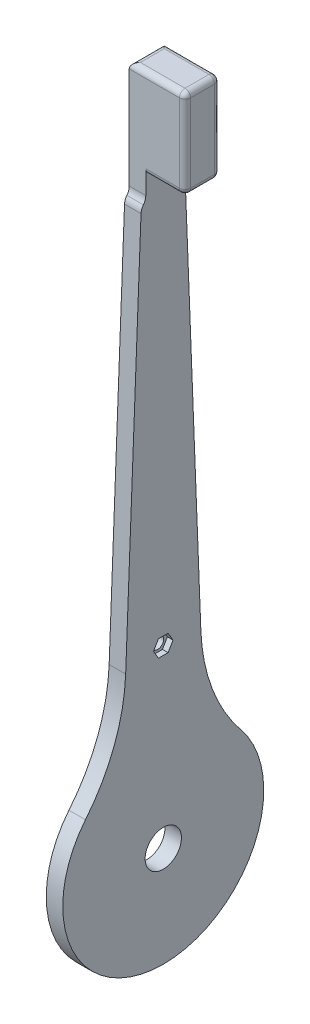
ISO-10303-21;
HEADER;
FILE_DESCRIPTION(('STEP AP214'),'2;1');
FILE_NAME('part.step','',(''),(''),'','','');
FILE_SCHEMA(('AUTOMOTIVE_DESIGN { 1 0 10303 214 1 1 1 1 }'));
ENDSEC;
DATA;
#1=APPLICATION_CONTEXT('core data for automotive mechanical design processes');
#2=APPLICATION_PROTOCOL_DEFINITION('international standard','automotive_design',2000,#1);
#3=PRODUCT_CONTEXT('',#1,'mechanical');
#4=PRODUCT('Part','Part','',(#3));
#5=PRODUCT_RELATED_PRODUCT_CATEGORY('part','',(#4));
#6=PRODUCT_DEFINITION_FORMATION('','',#4);
#7=PRODUCT_DEFINITION_CONTEXT('part definition',#1,'design');
#8=PRODUCT_DEFINITION('design','',#6,#7);
#9=PRODUCT_DEFINITION_SHAPE('','',#8);
#10=(LENGTH_UNIT() NAMED_UNIT(*) SI_UNIT(.MILLI.,.METRE.));
#11=(NAMED_UNIT(*) PLANE_ANGLE_UNIT() SI_UNIT($,.RADIAN.));
#12=(NAMED_UNIT(*) SI_UNIT($,.STERADIAN.) SOLID_ANGLE_UNIT());
#13=UNCERTAINTY_MEASURE_WITH_UNIT(LENGTH_MEASURE(1.E-05),#10,'distance_accuracy_value','');
#14=(GEOMETRIC_REPRESENTATION_CONTEXT(3) GLOBAL_UNCERTAINTY_ASSIGNED_CONTEXT((#13)) GLOBAL_UNIT_ASSIGNED_CONTEXT((#10,
#11,#12)) REPRESENTATION_CONTEXT('',''));
#15=CARTESIAN_POINT('',(0.,0.,0.));
#16=DIRECTION('',(0.,0.,1.));
#17=DIRECTION('',(1.,0.,0.));
#18=AXIS2_PLACEMENT_3D('',#15,#16,#17);
#19=CARTESIAN_POINT('',(3.175,49.887280480133,0.));
#20=DIRECTION('',(1.,0.,0.));
#21=DIRECTION('',(0.,0.,-1.));
#22=AXIS2_PLACEMENT_3D('',#19,#20,#21);
#23=CYLINDRICAL_SURFACE('',#22,1.72719999999999);
#24=CARTESIAN_POINT('',(-1.524,49.887280480133,0.));
#25=DIRECTION('',(1.,0.,0.));
#26=DIRECTION('',(0.,0.,-1.));
#27=AXIS2_PLACEMENT_3D('',#24,#25,#26);
#28=CIRCLE('',#27,1.7272);
#29=CARTESIAN_POINT('',(-1.524,49.887280480133,-1.7272));
#30=VERTEX_POINT('',#29);
#31=EDGE_CURVE('E266',#30,#30,#28,.T.);
#32=ORIENTED_EDGE('',*,*,#31,.F.);
#33=EDGE_LOOP('',(#32));
#34=FACE_BOUND('',#33,.T.);
#35=CARTESIAN_POINT('',(1.5748,49.887280480133,0.));
#36=DIRECTION('',(1.,0.,0.));
#37=DIRECTION('',(0.,0.,-1.));
#38=AXIS2_PLACEMENT_3D('',#35,#36,#37);
#39=CIRCLE('',#38,1.72719999999999);
#40=CARTESIAN_POINT('',(1.5748,49.887280480133,-1.72719999999999));
#41=VERTEX_POINT('',#40);
#42=EDGE_CURVE('E42',#41,#41,#39,.F.);
#43=ORIENTED_EDGE('',*,*,#42,.F.);
#44=EDGE_LOOP('',(#43));
#45=FACE_BOUND('',#44,.T.);
#46=ADVANCED_FACE('F38',(#34,#45),#23,.F.);
#47=CARTESIAN_POINT('',(-1.524,0.493768041256587,12.5672358479502));
#48=DIRECTION('',(0.,0.0392598157590686,0.999229036240723));
#49=DIRECTION('',(0.,-0.999229036240723,0.0392598157590686));
#50=AXIS2_PLACEMENT_3D('',#47,#48,#49);
#51=PLANE('',#50);
#52=DIRECTION('',(0.,-0.999229036240723,0.0392598157590686));
#53=VECTOR('',#52,1.);
#54=CARTESIAN_POINT('',(-1.524,0.493768041256587,12.5672358479502));
#55=LINE('',#54,#53);
#56=CARTESIAN_POINT('',(-1.524,159.453678557024,6.32168395385614));
#57=VERTEX_POINT('',#56);
#58=CARTESIAN_POINT('',(-1.524,48.2455749354104,10.6910622452694));
#59=VERTEX_POINT('',#58);
#60=EDGE_CURVE('E300',#57,#59,#55,.T.);
#61=ORIENTED_EDGE('',*,*,#60,.T.);
#62=DIRECTION('',(-1.,0.,0.));
#63=VECTOR('',#62,1.);
#64=CARTESIAN_POINT('',(3.175,48.2455749354104,10.6910622452694));
#65=LINE('',#64,#63);
#66=CARTESIAN_POINT('',(3.175,48.2455749354104,10.6910622452694));
#67=VERTEX_POINT('',#66);
#68=EDGE_CURVE('E386',#59,#67,#65,.F.);
#69=ORIENTED_EDGE('',*,*,#68,.T.);
#70=DIRECTION('',(0.,-0.999229036240723,0.0392598157590686));
#71=VECTOR('',#70,1.);
#72=CARTESIAN_POINT('',(3.175,0.493768041256587,12.5672358479502));
#73=LINE('',#72,#71);
#74=CARTESIAN_POINT('',(3.175,159.453678557024,6.32168395385613));
#75=VERTEX_POINT('',#74);
#76=EDGE_CURVE('E295',#75,#67,#73,.T.);
#77=ORIENTED_EDGE('',*,*,#76,.F.);
#78=DIRECTION('',(1.,0.,0.));
#79=VECTOR('',#78,1.);
#80=CARTESIAN_POINT('',(-1.524,159.453678557024,6.32168395385613));
#81=LINE('',#80,#79);
#82=EDGE_CURVE('E311',#75,#57,#81,.F.);
#83=ORIENTED_EDGE('',*,*,#82,.T.);
#84=EDGE_LOOP('',(#61,#69,#77,#83));
#85=FACE_BOUND('',#84,.T.);
#86=ADVANCED_FACE('F448',(#85),#51,.T.);
#87=CARTESIAN_POINT('',(-1.524,0.,0.));
#88=DIRECTION('',(1.,0.,0.));
#89=DIRECTION('',(0.,0.,-1.));
#90=AXIS2_PLACEMENT_3D('',#87,#88,#89);
#91=PLANE('',#90);
#92=ORIENTED_EDGE('',*,*,#31,.T.);
#93=EDGE_LOOP('',(#92));
#94=FACE_BOUND('',#93,.T.);
#95=CARTESIAN_POINT('',(-1.524,0.,0.));
#96=DIRECTION('',(1.,0.,0.));
#97=DIRECTION('',(0.,0.,-1.));
#98=AXIS2_PLACEMENT_3D('',#95,#96,#97);
#99=CIRCLE('',#98,5.15874);
#100=CARTESIAN_POINT('',(-1.524,0.,-5.15874));
#101=VERTEX_POINT('',#100);
#102=EDGE_CURVE('E272',#101,#101,#99,.T.);
#103=ORIENTED_EDGE('',*,*,#102,.T.);
#104=EDGE_LOOP('',(#103));
#105=FACE_BOUND('',#104,.T.);
#106=DIRECTION('',(0.,-1.,0.));
#107=VECTOR('',#106,1.);
#108=CARTESIAN_POINT('',(-1.524,0.,4.97712457241772));
#109=LINE('',#108,#107);
#110=CARTESIAN_POINT('',(-1.524,192.0875,4.97712457241776));
#111=VERTEX_POINT('',#110);
#112=CARTESIAN_POINT('',(-1.524,163.239599310937,4.97712457241776));
#113=VERTEX_POINT('',#112);
#114=EDGE_CURVE('E290',#111,#113,#109,.T.);
#115=ORIENTED_EDGE('',*,*,#114,.F.);
#116=DIRECTION('',(0.,0.,-1.));
#117=VECTOR('',#116,1.);
#118=CARTESIAN_POINT('',(-1.524,192.0875,0.));
#119=LINE('',#118,#117);
#120=CARTESIAN_POINT('',(-1.524,192.0875,-4.97712457241771));
#121=VERTEX_POINT('',#120);
#122=EDGE_CURVE('E379',#111,#121,#119,.T.);
#123=ORIENTED_EDGE('',*,*,#122,.T.);
#124=DIRECTION('',(0.,-1.,0.));
#125=VECTOR('',#124,1.);
#126=CARTESIAN_POINT('',(-1.524,0.,-4.97712457241771));
#127=LINE('',#126,#125);
#128=CARTESIAN_POINT('',(-1.524,163.239599310937,-4.97712457241771));
#129=VERTEX_POINT('',#128);
#130=EDGE_CURVE('E284',#121,#129,#127,.T.);
#131=ORIENTED_EDGE('',*,*,#130,.T.);
#132=CARTESIAN_POINT('',(-1.524,163.239599310937,-8.15212457241771));
#133=DIRECTION('',(1.,0.,0.));
#134=DIRECTION('',(0.,0.,-1.));
#135=AXIS2_PLACEMENT_3D('',#132,#133,#134);
#136=CIRCLE('',#135,3.175);
#137=CARTESIAN_POINT('',(-1.524,161.284313976463,-5.65062816810476));
#138=VERTEX_POINT('',#137);
#139=EDGE_CURVE('E339',#129,#138,#136,.T.);
#140=ORIENTED_EDGE('',*,*,#139,.T.);
#141=CARTESIAN_POINT('',(-1.524,159.329028641989,-3.1491317637918));
#142=DIRECTION('',(1.,0.,0.));
#143=DIRECTION('',(0.,0.,-1.));
#144=AXIS2_PLACEMENT_3D('',#141,#142,#143);
#145=CIRCLE('',#144,3.175);
#146=CARTESIAN_POINT('',(-1.524,159.453678557024,-6.32168395385609));
#147=VERTEX_POINT('',#146);
#148=EDGE_CURVE('E313',#138,#147,#145,.F.);
#149=ORIENTED_EDGE('',*,*,#148,.T.);
#150=DIRECTION('',(0.,-0.999229036240723,-0.0392598157590689));
#151=VECTOR('',#150,1.);
#152=CARTESIAN_POINT('',(-1.524,0.493768041256591,-12.5672358479503));
#153=LINE('',#152,#151);
#154=CARTESIAN_POINT('',(-1.524,48.2455749354104,-10.6910622452694));
#155=VERTEX_POINT('',#154);
#156=EDGE_CURVE('E303',#147,#155,#153,.T.);
#157=ORIENTED_EDGE('',*,*,#156,.T.);
#158=CARTESIAN_POINT('',(-1.524,50.2399735759711,-61.4518972862981));
#159=DIRECTION('',(1.,0.,0.));
#160=DIRECTION('',(0.,0.,-1.));
#161=AXIS2_PLACEMENT_3D('',#158,#159,#160);
#162=CIRCLE('',#161,50.8);
#163=CARTESIAN_POINT('',(-1.524,18.0863904873496,-22.1226830230673));
#164=VERTEX_POINT('',#163);
#165=EDGE_CURVE('E11',#155,#164,#162,.T.);
#166=ORIENTED_EDGE('',*,*,#165,.T.);
#167=CARTESIAN_POINT('',(-1.524,0.,0.));
#168=DIRECTION('',(1.,0.,0.));
#169=DIRECTION('',(0.,0.,-1.));
#170=AXIS2_PLACEMENT_3D('',#167,#168,#169);
#171=CIRCLE('',#170,28.575);
#172=CARTESIAN_POINT('',(-1.524,18.0863904873496,22.1226830230673));
#173=VERTEX_POINT('',#172);
#174=EDGE_CURVE('E277',#164,#173,#171,.F.);
#175=ORIENTED_EDGE('',*,*,#174,.T.);
#176=CARTESIAN_POINT('',(-1.524,50.239973575971,61.4518972862981));
#177=DIRECTION('',(1.,0.,0.));
#178=DIRECTION('',(0.,0.,-1.));
#179=AXIS2_PLACEMENT_3D('',#176,#177,#178);
#180=CIRCLE('',#179,50.8);
#181=EDGE_CURVE('E435',#173,#59,#180,.T.);
#182=ORIENTED_EDGE('',*,*,#181,.T.);
#183=ORIENTED_EDGE('',*,*,#60,.F.);
#184=CARTESIAN_POINT('',(-1.524,159.329028641989,3.14913176379184));
#185=DIRECTION('',(1.,0.,0.));
#186=DIRECTION('',(0.,0.,-1.));
#187=AXIS2_PLACEMENT_3D('',#184,#185,#186);
#188=CIRCLE('',#187,3.175);
#189=CARTESIAN_POINT('',(-1.524,161.284313976463,5.6506281681048));
#190=VERTEX_POINT('',#189);
#191=EDGE_CURVE('E315',#57,#190,#188,.F.);
#192=ORIENTED_EDGE('',*,*,#191,.T.);
#193=CARTESIAN_POINT('',(-1.524,163.239599310937,8.15212457241776));
#194=DIRECTION('',(1.,0.,0.));
#195=DIRECTION('',(0.,0.,-1.));
#196=AXIS2_PLACEMENT_3D('',#193,#194,#195);
#197=CIRCLE('',#196,3.175);
#198=EDGE_CURVE('E334',#190,#113,#197,.T.);
#199=ORIENTED_EDGE('',*,*,#198,.T.);
#200=EDGE_LOOP('',(#115,#123,#131,#140,#149,#157,#166,#175,#182,#183,#192,#199));
#201=FACE_BOUND('',#200,.T.);
#202=ADVANCED_FACE('F441',(#94,#105,#201),#91,.F.);
#203=CARTESIAN_POINT('',(3.175,0.,0.));
#204=DIRECTION('',(1.,0.,0.));
#205=DIRECTION('',(0.,0.,-1.));
#206=AXIS2_PLACEMENT_3D('',#203,#204,#205);
#207=PLANE('',#206);
#208=DIRECTION('',(0.,-0.866025403784438,-0.500000000000001));
#209=VECTOR('',#208,1.);
#210=CARTESIAN_POINT('',(3.175,49.8872804801304,2.76468815109874));
#211=LINE('',#210,#209);
#212=CARTESIAN_POINT('',(3.175,49.8872804801304,2.76468815109874));
#213=VERTEX_POINT('',#212);
#214=CARTESIAN_POINT('',(3.175,47.4929903077377,1.38234407554971));
#215=VERTEX_POINT('',#214);
#216=EDGE_CURVE('E54',#213,#215,#211,.T.);
#217=ORIENTED_EDGE('',*,*,#216,.F.);
#218=DIRECTION('',(0.,-0.866025403784439,0.499999999999999));
#219=VECTOR('',#218,1.);
#220=CARTESIAN_POINT('',(3.175,52.2815706525232,1.38234407554971));
#221=LINE('',#220,#219);
#222=CARTESIAN_POINT('',(3.175,52.2815706525232,1.38234407554971));
#223=VERTEX_POINT('',#222);
#224=EDGE_CURVE('E233',#223,#213,#221,.T.);
#225=ORIENTED_EDGE('',*,*,#224,.F.);
#226=DIRECTION('',(0.,0.,1.));
#227=VECTOR('',#226,1.);
#228=CARTESIAN_POINT('',(3.175,52.2815706525232,-1.38234407554836));
#229=LINE('',#228,#227);
#230=CARTESIAN_POINT('',(3.175,52.2815706525232,-1.38234407554836));
#231=VERTEX_POINT('',#230);
#232=EDGE_CURVE('E236',#231,#223,#229,.T.);
#233=ORIENTED_EDGE('',*,*,#232,.F.);
#234=DIRECTION('',(0.,0.866025403784439,0.499999999999999));
#235=VECTOR('',#234,1.);
#236=CARTESIAN_POINT('',(3.175,49.8872804801304,-2.76468815109739));
#237=LINE('',#236,#235);
#238=CARTESIAN_POINT('',(3.175,49.8872804801304,-2.76468815109739));
#239=VERTEX_POINT('',#238);
#240=EDGE_CURVE('E252',#239,#231,#237,.T.);
#241=ORIENTED_EDGE('',*,*,#240,.F.);
#242=DIRECTION('',(0.,0.866025403784439,-0.5));
#243=VECTOR('',#242,1.);
#244=CARTESIAN_POINT('',(3.175,47.4929903077377,-1.38234407554837));
#245=LINE('',#244,#243);
#246=CARTESIAN_POINT('',(3.175,47.4929903077377,-1.38234407554837));
#247=VERTEX_POINT('',#246);
#248=EDGE_CURVE('E249',#247,#239,#245,.T.);
#249=ORIENTED_EDGE('',*,*,#248,.F.);
#250=DIRECTION('',(0.,0.,-1.));
#251=VECTOR('',#250,1.);
#252=CARTESIAN_POINT('',(3.175,47.4929903077377,1.38234407554971));
#253=LINE('',#252,#251);
#254=EDGE_CURVE('E247',#215,#247,#253,.T.);
#255=ORIENTED_EDGE('',*,*,#254,.F.);
#256=EDGE_LOOP('',(#217,#225,#233,#241,#249,#255));
#257=FACE_BOUND('',#256,.T.);
#258=CARTESIAN_POINT('',(3.175,0.,0.));
#259=DIRECTION('',(1.,0.,0.));
#260=DIRECTION('',(0.,0.,-1.));
#261=AXIS2_PLACEMENT_3D('',#258,#259,#260);
#262=CIRCLE('',#261,5.15874);
#263=CARTESIAN_POINT('',(3.175,0.,-5.15874));
#264=VERTEX_POINT('',#263);
#265=EDGE_CURVE('E269',#264,#264,#262,.T.);
#266=ORIENTED_EDGE('',*,*,#265,.F.);
#267=EDGE_LOOP('',(#266));
#268=FACE_BOUND('',#267,.T.);
#269=DIRECTION('',(0.,-1.,0.));
#270=VECTOR('',#269,1.);
#271=CARTESIAN_POINT('',(3.175,0.,4.97712457241772));
#272=LINE('',#271,#270);
#273=CARTESIAN_POINT('',(3.175,169.8625,4.97712457241776));
#274=VERTEX_POINT('',#273);
#275=CARTESIAN_POINT('',(3.175,163.239599310937,4.97712457241776));
#276=VERTEX_POINT('',#275);
#277=EDGE_CURVE('E287',#274,#276,#272,.T.);
#278=ORIENTED_EDGE('',*,*,#277,.T.);
#279=CARTESIAN_POINT('',(3.175,163.239599310937,8.15212457241776));
#280=DIRECTION('',(1.,0.,0.));
#281=DIRECTION('',(0.,0.,-1.));
#282=AXIS2_PLACEMENT_3D('',#279,#280,#281);
#283=CIRCLE('',#282,3.175);
#284=CARTESIAN_POINT('',(3.175,161.284313976463,5.6506281681048));
#285=VERTEX_POINT('',#284);
#286=EDGE_CURVE('E332',#276,#285,#283,.F.);
#287=ORIENTED_EDGE('',*,*,#286,.T.);
#288=CARTESIAN_POINT('',(3.175,159.329028641989,3.14913176379184));
#289=DIRECTION('',(1.,0.,0.));
#290=DIRECTION('',(0.,0.,-1.));
#291=AXIS2_PLACEMENT_3D('',#288,#289,#290);
#292=CIRCLE('',#291,3.175);
#293=EDGE_CURVE('E309',#285,#75,#292,.T.);
#294=ORIENTED_EDGE('',*,*,#293,.T.);
#295=ORIENTED_EDGE('',*,*,#76,.T.);
#296=CARTESIAN_POINT('',(3.175,50.239973575971,61.4518972862981));
#297=DIRECTION('',(1.,0.,0.));
#298=DIRECTION('',(0.,0.,-1.));
#299=AXIS2_PLACEMENT_3D('',#296,#297,#298);
#300=CIRCLE('',#299,50.8);
#301=CARTESIAN_POINT('',(3.175,18.0863904873496,22.1226830230673));
#302=VERTEX_POINT('',#301);
#303=EDGE_CURVE('E433',#67,#302,#300,.F.);
#304=ORIENTED_EDGE('',*,*,#303,.T.);
#305=CARTESIAN_POINT('',(3.175,0.,0.));
#306=DIRECTION('',(1.,0.,0.));
#307=DIRECTION('',(0.,0.,-1.));
#308=AXIS2_PLACEMENT_3D('',#305,#306,#307);
#309=CIRCLE('',#308,28.575);
#310=CARTESIAN_POINT('',(3.175,18.0863904873496,-22.1226830230673));
#311=VERTEX_POINT('',#310);
#312=EDGE_CURVE('E275',#302,#311,#309,.T.);
#313=ORIENTED_EDGE('',*,*,#312,.T.);
#314=CARTESIAN_POINT('',(3.175,50.2399735759711,-61.4518972862981));
#315=DIRECTION('',(1.,0.,0.));
#316=DIRECTION('',(0.,0.,-1.));
#317=AXIS2_PLACEMENT_3D('',#314,#315,#316);
#318=CIRCLE('',#317,50.8);
#319=CARTESIAN_POINT('',(3.175,48.2455749354104,-10.6910622452694));
#320=VERTEX_POINT('',#319);
#321=EDGE_CURVE('E47',#311,#320,#318,.F.);
#322=ORIENTED_EDGE('',*,*,#321,.T.);
#323=DIRECTION('',(0.,-0.999229036240723,-0.0392598157590689));
#324=VECTOR('',#323,1.);
#325=CARTESIAN_POINT('',(3.175,0.493768041256591,-12.5672358479503));
#326=LINE('',#325,#324);
#327=CARTESIAN_POINT('',(3.175,159.453678557024,-6.32168395385609));
#328=VERTEX_POINT('',#327);
#329=EDGE_CURVE('E298',#328,#320,#326,.T.);
#330=ORIENTED_EDGE('',*,*,#329,.F.);
#331=CARTESIAN_POINT('',(3.175,159.329028641989,-3.1491317637918));
#332=DIRECTION('',(1.,0.,0.));
#333=DIRECTION('',(0.,0.,-1.));
#334=AXIS2_PLACEMENT_3D('',#331,#332,#333);
#335=CIRCLE('',#334,3.175);
#336=CARTESIAN_POINT('',(3.175,161.284313976463,-5.65062816810476));
#337=VERTEX_POINT('',#336);
#338=EDGE_CURVE('E306',#328,#337,#335,.T.);
#339=ORIENTED_EDGE('',*,*,#338,.T.);
#340=CARTESIAN_POINT('',(3.175,163.239599310937,-8.15212457241771));
#341=DIRECTION('',(1.,0.,0.));
#342=DIRECTION('',(0.,0.,-1.));
#343=AXIS2_PLACEMENT_3D('',#340,#341,#342);
#344=CIRCLE('',#343,3.175);
#345=CARTESIAN_POINT('',(3.175,163.239599310937,-4.97712457241771));
#346=VERTEX_POINT('',#345);
#347=EDGE_CURVE('E337',#337,#346,#344,.F.);
#348=ORIENTED_EDGE('',*,*,#347,.T.);
#349=DIRECTION('',(0.,-1.,0.));
#350=VECTOR('',#349,1.);
#351=CARTESIAN_POINT('',(3.175,0.,-4.97712457241771));
#352=LINE('',#351,#350);
#353=CARTESIAN_POINT('',(3.175,169.8625,-4.97712457241771));
#354=VERTEX_POINT('',#353);
#355=EDGE_CURVE('E281',#354,#346,#352,.T.);
#356=ORIENTED_EDGE('',*,*,#355,.F.);
#357=CARTESIAN_POINT('',(3.175,169.8625,-3.38962457241771));
#358=DIRECTION('',(1.,0.,0.));
#359=DIRECTION('',(0.,0.,-1.));
#360=AXIS2_PLACEMENT_3D('',#357,#358,#359);
#361=CIRCLE('',#360,1.5875);
#362=CARTESIAN_POINT('',(3.175,168.275,-3.38962457241771));
#363=VERTEX_POINT('',#362);
#364=EDGE_CURVE('E384',#354,#363,#361,.F.);
#365=ORIENTED_EDGE('',*,*,#364,.T.);
#366=DIRECTION('',(0.,0.,-1.));
#367=VECTOR('',#366,1.);
#368=CARTESIAN_POINT('',(3.175,168.275,4.97712457241776));
#369=LINE('',#368,#367);
#370=CARTESIAN_POINT('',(3.175,168.275,3.38962457241776));
#371=VERTEX_POINT('',#370);
#372=EDGE_CURVE('E292',#371,#363,#369,.T.);
#373=ORIENTED_EDGE('',*,*,#372,.F.);
#374=CARTESIAN_POINT('',(3.175,169.8625,3.38962457241776));
#375=DIRECTION('',(1.,0.,0.));
#376=DIRECTION('',(0.,0.,-1.));
#377=AXIS2_PLACEMENT_3D('',#374,#375,#376);
#378=CIRCLE('',#377,1.5875);
#379=EDGE_CURVE('E381',#371,#274,#378,.F.);
#380=ORIENTED_EDGE('',*,*,#379,.T.);
#381=EDGE_LOOP('',(#278,#287,#294,#295,#304,#313,#322,#330,#339,#348,#356,#365,#373,#380));
#382=FACE_BOUND('',#381,.T.);
#383=ADVANCED_FACE('F453',(#257,#268,#382),#207,.T.);
#384=CARTESIAN_POINT('',(-1.524,193.675,0.));
#385=DIRECTION('',(0.,-1.,0.));
#386=DIRECTION('',(0.,0.,-1.));
#387=AXIS2_PLACEMENT_3D('',#384,#385,#386);
#388=PLANE('',#387);
#389=DIRECTION('',(1.,0.,0.));
#390=VECTOR('',#389,1.);
#391=CARTESIAN_POINT('',(-1.524,193.675,-3.38962457241771));
#392=LINE('',#391,#390);
#393=CARTESIAN_POINT('',(12.7635,193.675,-3.38962457241771));
#394=VERTEX_POINT('',#393);
#395=CARTESIAN_POINT('',(0.0635,193.675,-3.38962457241771));
#396=VERTEX_POINT('',#395);
#397=EDGE_CURVE('E353',#394,#396,#392,.F.);
#398=ORIENTED_EDGE('',*,*,#397,.T.);
#399=DIRECTION('',(0.,0.,-1.));
#400=VECTOR('',#399,1.);
#401=CARTESIAN_POINT('',(0.0635,193.675,0.));
#402=LINE('',#401,#400);
#403=CARTESIAN_POINT('',(0.0635,193.675,3.38962457241776));
#404=VERTEX_POINT('',#403);
#405=EDGE_CURVE('E356',#396,#404,#402,.F.);
#406=ORIENTED_EDGE('',*,*,#405,.T.);
#407=DIRECTION('',(1.,0.,0.));
#408=VECTOR('',#407,1.);
#409=CARTESIAN_POINT('',(-1.524,193.675,3.38962457241776));
#410=LINE('',#409,#408);
#411=CARTESIAN_POINT('',(12.7635,193.675,3.38962457241776));
#412=VERTEX_POINT('',#411);
#413=EDGE_CURVE('E351',#404,#412,#410,.T.);
#414=ORIENTED_EDGE('',*,*,#413,.T.);
#415=DIRECTION('',(0.,0.,1.));
#416=VECTOR('',#415,1.);
#417=CARTESIAN_POINT('',(12.7635,193.675,-4.97712457241771));
#418=LINE('',#417,#416);
#419=EDGE_CURVE('E349',#412,#394,#418,.F.);
#420=ORIENTED_EDGE('',*,*,#419,.T.);
#421=EDGE_LOOP('',(#398,#406,#414,#420));
#422=FACE_BOUND('',#421,.T.);
#423=ADVANCED_FACE('F582',(#422),#388,.F.);
#424=CARTESIAN_POINT('',(-1.524,0.493768041256591,-12.5672358479503));
#425=DIRECTION('',(0.,-0.0392598157590689,0.999229036240723));
#426=DIRECTION('',(0.,-0.999229036240723,-0.0392598157590689));
#427=AXIS2_PLACEMENT_3D('',#424,#425,#426);
#428=PLANE('',#427);
#429=ORIENTED_EDGE('',*,*,#329,.T.);
#430=DIRECTION('',(1.,0.,0.));
#431=VECTOR('',#430,1.);
#432=CARTESIAN_POINT('',(-1.524,48.2455749354104,-10.6910622452694));
#433=LINE('',#432,#431);
#434=EDGE_CURVE('E431',#320,#155,#433,.F.);
#435=ORIENTED_EDGE('',*,*,#434,.T.);
#436=ORIENTED_EDGE('',*,*,#156,.F.);
#437=DIRECTION('',(-1.,0.,0.));
#438=VECTOR('',#437,1.);
#439=CARTESIAN_POINT('',(-1.524,159.453678557024,-6.32168395385609));
#440=LINE('',#439,#438);
#441=EDGE_CURVE('E318',#147,#328,#440,.F.);
#442=ORIENTED_EDGE('',*,*,#441,.T.);
#443=EDGE_LOOP('',(#429,#435,#436,#442));
#444=FACE_BOUND('',#443,.T.);
#445=ADVANCED_FACE('F462',(#444),#428,.F.);
#446=CARTESIAN_POINT('',(14.351,193.675,4.97712457241776));
#447=DIRECTION('',(0.,0.,-1.));
#448=DIRECTION('',(0.,1.,0.));
#449=AXIS2_PLACEMENT_3D('',#446,#447,#448);
#450=PLANE('',#449);
#451=ORIENTED_EDGE('',*,*,#277,.F.);
#452=DIRECTION('',(-1.,0.,0.));
#453=VECTOR('',#452,1.);
#454=CARTESIAN_POINT('',(14.351,169.8625,4.97712457241776));
#455=LINE('',#454,#453);
#456=CARTESIAN_POINT('',(12.7635,169.8625,4.97712457241776));
#457=VERTEX_POINT('',#456);
#458=EDGE_CURVE('E368',#274,#457,#455,.F.);
#459=ORIENTED_EDGE('',*,*,#458,.T.);
#460=DIRECTION('',(0.,-1.,0.));
#461=VECTOR('',#460,1.);
#462=CARTESIAN_POINT('',(12.7635,193.675,4.97712457241776));
#463=LINE('',#462,#461);
#464=CARTESIAN_POINT('',(12.7635,192.0875,4.97712457241776));
#465=VERTEX_POINT('',#464);
#466=EDGE_CURVE('E364',#457,#465,#463,.F.);
#467=ORIENTED_EDGE('',*,*,#466,.T.);
#468=DIRECTION('',(1.,0.,0.));
#469=VECTOR('',#468,1.);
#470=CARTESIAN_POINT('',(14.351,192.0875,4.97712457241776));
#471=LINE('',#470,#469);
#472=EDGE_CURVE('E366',#465,#111,#471,.F.);
#473=ORIENTED_EDGE('',*,*,#472,.T.);
#474=ORIENTED_EDGE('',*,*,#114,.T.);
#475=DIRECTION('',(-1.,0.,0.));
#476=VECTOR('',#475,1.);
#477=CARTESIAN_POINT('',(14.351,163.239599310937,4.97712457241776));
#478=LINE('',#477,#476);
#479=EDGE_CURVE('E321',#113,#276,#478,.F.);
#480=ORIENTED_EDGE('',*,*,#479,.T.);
#481=EDGE_LOOP('',(#451,#459,#467,#473,#474,#480));
#482=FACE_BOUND('',#481,.T.);
#483=ADVANCED_FACE('F512',(#482),#450,.F.);
#484=CARTESIAN_POINT('',(14.351,168.275,4.97712457241776));
#485=DIRECTION('',(0.,1.,0.));
#486=DIRECTION('',(0.,0.,1.));
#487=AXIS2_PLACEMENT_3D('',#484,#485,#486);
#488=PLANE('',#487);
#489=DIRECTION('',(0.,0.,-1.));
#490=VECTOR('',#489,1.);
#491=CARTESIAN_POINT('',(12.7635,168.275,4.97712457241776));
#492=LINE('',#491,#490);
#493=CARTESIAN_POINT('',(12.7635,168.275,-3.38962457241771));
#494=VERTEX_POINT('',#493);
#495=CARTESIAN_POINT('',(12.7635,168.275,3.38962457241776));
#496=VERTEX_POINT('',#495);
#497=EDGE_CURVE('E358',#494,#496,#492,.F.);
#498=ORIENTED_EDGE('',*,*,#497,.T.);
#499=DIRECTION('',(-1.,0.,0.));
#500=VECTOR('',#499,1.);
#501=CARTESIAN_POINT('',(14.351,168.275,3.38962457241776));
#502=LINE('',#501,#500);
#503=EDGE_CURVE('E362',#496,#371,#502,.T.);
#504=ORIENTED_EDGE('',*,*,#503,.T.);
#505=ORIENTED_EDGE('',*,*,#372,.T.);
#506=DIRECTION('',(-1.,0.,0.));
#507=VECTOR('',#506,1.);
#508=CARTESIAN_POINT('',(14.351,168.275,-3.38962457241771));
#509=LINE('',#508,#507);
#510=EDGE_CURVE('E360',#363,#494,#509,.F.);
#511=ORIENTED_EDGE('',*,*,#510,.T.);
#512=EDGE_LOOP('',(#498,#504,#505,#511));
#513=FACE_BOUND('',#512,.T.);
#514=ADVANCED_FACE('F485',(#513),#488,.F.);
#515=CARTESIAN_POINT('',(14.351,168.275,-4.97712457241771));
#516=DIRECTION('',(0.,0.,1.));
#517=DIRECTION('',(1.,0.,0.));
#518=AXIS2_PLACEMENT_3D('',#515,#516,#517);
#519=PLANE('',#518);
#520=DIRECTION('',(-1.,0.,0.));
#521=VECTOR('',#520,1.);
#522=CARTESIAN_POINT('',(14.351,169.8625,-4.97712457241771));
#523=LINE('',#522,#521);
#524=CARTESIAN_POINT('',(12.7635,169.8625,-4.97712457241771));
#525=VERTEX_POINT('',#524);
#526=EDGE_CURVE('E343',#525,#354,#523,.T.);
#527=ORIENTED_EDGE('',*,*,#526,.T.);
#528=ORIENTED_EDGE('',*,*,#355,.T.);
#529=DIRECTION('',(-1.,0.,0.));
#530=VECTOR('',#529,1.);
#531=CARTESIAN_POINT('',(14.351,163.239599310937,-4.97712457241771));
#532=LINE('',#531,#530);
#533=EDGE_CURVE('E329',#346,#129,#532,.T.);
#534=ORIENTED_EDGE('',*,*,#533,.T.);
#535=ORIENTED_EDGE('',*,*,#130,.F.);
#536=DIRECTION('',(1.,0.,0.));
#537=VECTOR('',#536,1.);
#538=CARTESIAN_POINT('',(14.351,192.0875,-4.97712457241771));
#539=LINE('',#538,#537);
#540=CARTESIAN_POINT('',(12.7635,192.0875,-4.97712457241771));
#541=VERTEX_POINT('',#540);
#542=EDGE_CURVE('E346',#121,#541,#539,.T.);
#543=ORIENTED_EDGE('',*,*,#542,.T.);
#544=DIRECTION('',(0.,1.,0.));
#545=VECTOR('',#544,1.);
#546=CARTESIAN_POINT('',(12.7635,168.275,-4.97712457241771));
#547=LINE('',#546,#545);
#548=EDGE_CURVE('E341',#541,#525,#547,.F.);
#549=ORIENTED_EDGE('',*,*,#548,.T.);
#550=EDGE_LOOP('',(#527,#528,#534,#535,#543,#549));
#551=FACE_BOUND('',#550,.T.);
#552=ADVANCED_FACE('F473',(#551),#519,.F.);
#553=CARTESIAN_POINT('',(14.351,0.,0.));
#554=DIRECTION('',(1.,0.,0.));
#555=DIRECTION('',(0.,0.,-1.));
#556=AXIS2_PLACEMENT_3D('',#553,#554,#555);
#557=PLANE('',#556);
#558=DIRECTION('',(0.,1.,0.));
#559=VECTOR('',#558,1.);
#560=CARTESIAN_POINT('',(14.351,193.675,-3.38962457241771));
#561=LINE('',#560,#559);
#562=CARTESIAN_POINT('',(14.351,169.8625,-3.38962457241771));
#563=VERTEX_POINT('',#562);
#564=CARTESIAN_POINT('',(14.351,192.0875,-3.38962457241771));
#565=VERTEX_POINT('',#564);
#566=EDGE_CURVE('E374',#563,#565,#561,.T.);
#567=ORIENTED_EDGE('',*,*,#566,.T.);
#568=DIRECTION('',(0.,0.,1.));
#569=VECTOR('',#568,1.);
#570=CARTESIAN_POINT('',(14.351,192.0875,4.97712457241776));
#571=LINE('',#570,#569);
#572=CARTESIAN_POINT('',(14.351,192.0875,3.38962457241776));
#573=VERTEX_POINT('',#572);
#574=EDGE_CURVE('E377',#565,#573,#571,.T.);
#575=ORIENTED_EDGE('',*,*,#574,.T.);
#576=DIRECTION('',(0.,-1.,0.));
#577=VECTOR('',#576,1.);
#578=CARTESIAN_POINT('',(14.351,168.275,3.38962457241776));
#579=LINE('',#578,#577);
#580=CARTESIAN_POINT('',(14.351,169.8625,3.38962457241776));
#581=VERTEX_POINT('',#580);
#582=EDGE_CURVE('E372',#573,#581,#579,.T.);
#583=ORIENTED_EDGE('',*,*,#582,.T.);
#584=DIRECTION('',(0.,0.,-1.));
#585=VECTOR('',#584,1.);
#586=CARTESIAN_POINT('',(14.351,169.8625,-4.97712457241771));
#587=LINE('',#586,#585);
#588=EDGE_CURVE('E370',#581,#563,#587,.T.);
#589=ORIENTED_EDGE('',*,*,#588,.T.);
#590=EDGE_LOOP('',(#567,#575,#583,#589));
#591=FACE_BOUND('',#590,.T.);
#592=ADVANCED_FACE('F503',(#591),#557,.T.);
#593=CARTESIAN_POINT('',(-6.35,159.329028641989,3.14913176379184));
#594=DIRECTION('',(-1.,0.,0.));
#595=DIRECTION('',(0.,0.,1.));
#596=AXIS2_PLACEMENT_3D('',#593,#594,#595);
#597=CYLINDRICAL_SURFACE('',#596,3.175);
#598=ORIENTED_EDGE('',*,*,#293,.F.);
#599=DIRECTION('',(-1.,0.,0.));
#600=VECTOR('',#599,1.);
#601=CARTESIAN_POINT('',(-6.35,161.284313976463,5.6506281681048));
#602=LINE('',#601,#600);
#603=EDGE_CURVE('E324',#285,#190,#602,.T.);
#604=ORIENTED_EDGE('',*,*,#603,.T.);
#605=ORIENTED_EDGE('',*,*,#191,.F.);
#606=ORIENTED_EDGE('',*,*,#82,.F.);
#607=EDGE_LOOP('',(#598,#604,#605,#606));
#608=FACE_BOUND('',#607,.T.);
#609=ADVANCED_FACE('F519',(#608),#597,.T.);
#610=CARTESIAN_POINT('',(-6.35,159.329028641989,-3.1491317637918));
#611=DIRECTION('',(-1.,0.,0.));
#612=DIRECTION('',(0.,0.,1.));
#613=AXIS2_PLACEMENT_3D('',#610,#611,#612);
#614=CYLINDRICAL_SURFACE('',#613,3.175);
#615=ORIENTED_EDGE('',*,*,#148,.F.);
#616=DIRECTION('',(-1.,0.,0.));
#617=VECTOR('',#616,1.);
#618=CARTESIAN_POINT('',(-6.35,161.284313976463,-5.65062816810476));
#619=LINE('',#618,#617);
#620=EDGE_CURVE('E326',#138,#337,#619,.F.);
#621=ORIENTED_EDGE('',*,*,#620,.T.);
#622=ORIENTED_EDGE('',*,*,#338,.F.);
#623=ORIENTED_EDGE('',*,*,#441,.F.);
#624=EDGE_LOOP('',(#615,#621,#622,#623));
#625=FACE_BOUND('',#624,.T.);
#626=ADVANCED_FACE('F468',(#625),#614,.T.);
#627=CARTESIAN_POINT('',(-6.35,163.239599310937,8.15212457241776));
#628=DIRECTION('',(-1.,0.,0.));
#629=DIRECTION('',(0.,0.,1.));
#630=AXIS2_PLACEMENT_3D('',#627,#628,#629);
#631=CYLINDRICAL_SURFACE('',#630,3.175);
#632=ORIENTED_EDGE('',*,*,#198,.F.);
#633=ORIENTED_EDGE('',*,*,#603,.F.);
#634=ORIENTED_EDGE('',*,*,#286,.F.);
#635=ORIENTED_EDGE('',*,*,#479,.F.);
#636=EDGE_LOOP('',(#632,#633,#634,#635));
#637=FACE_BOUND('',#636,.T.);
#638=ADVANCED_FACE('F521',(#637),#631,.F.);
#639=CARTESIAN_POINT('',(-6.35,163.239599310937,-8.15212457241771));
#640=DIRECTION('',(-1.,0.,0.));
#641=DIRECTION('',(0.,0.,1.));
#642=AXIS2_PLACEMENT_3D('',#639,#640,#641);
#643=CYLINDRICAL_SURFACE('',#642,3.175);
#644=ORIENTED_EDGE('',*,*,#139,.F.);
#645=ORIENTED_EDGE('',*,*,#533,.F.);
#646=ORIENTED_EDGE('',*,*,#347,.F.);
#647=ORIENTED_EDGE('',*,*,#620,.F.);
#648=EDGE_LOOP('',(#644,#645,#646,#647));
#649=FACE_BOUND('',#648,.T.);
#650=ADVANCED_FACE('F470',(#649),#643,.F.);
#651=CARTESIAN_POINT('',(14.351,169.8625,3.38962457241776));
#652=DIRECTION('',(-1.,0.,0.));
#653=DIRECTION('',(0.,0.,1.));
#654=AXIS2_PLACEMENT_3D('',#651,#652,#653);
#655=CYLINDRICAL_SURFACE('',#654,1.5875);
#656=CARTESIAN_POINT('',(12.7635,169.8625,3.38962457241776));
#657=DIRECTION('',(1.,0.,0.));
#658=DIRECTION('',(0.,0.,-1.));
#659=AXIS2_PLACEMENT_3D('',#656,#657,#658);
#660=CIRCLE('',#659,1.5875);
#661=EDGE_CURVE('E285',#457,#496,#660,.T.);
#662=ORIENTED_EDGE('',*,*,#661,.F.);
#663=ORIENTED_EDGE('',*,*,#458,.F.);
#664=ORIENTED_EDGE('',*,*,#379,.F.);
#665=ORIENTED_EDGE('',*,*,#503,.F.);
#666=EDGE_LOOP('',(#662,#663,#664,#665));
#667=FACE_BOUND('',#666,.T.);
#668=ADVANCED_FACE('F490',(#667),#655,.T.);
#669=CARTESIAN_POINT('',(12.7635,169.8625,3.38962457241776));
#670=DIRECTION('',(0.,0.,1.));
#671=DIRECTION('',(1.,0.,0.));
#672=AXIS2_PLACEMENT_3D('',#669,#670,#671);
#673=SPHERICAL_SURFACE('',#672,1.5875);
#674=CARTESIAN_POINT('',(12.7635,169.8625,3.38962457241776));
#675=DIRECTION('',(0.,-1.,0.));
#676=DIRECTION('',(0.,0.,-1.));
#677=AXIS2_PLACEMENT_3D('',#674,#675,#676);
#678=CIRCLE('',#677,1.5875);
#679=EDGE_CURVE('E416',#457,#581,#678,.F.);
#680=ORIENTED_EDGE('',*,*,#679,.F.);
#681=ORIENTED_EDGE('',*,*,#661,.T.);
#682=CARTESIAN_POINT('',(12.7635,169.8625,3.38962457241776));
#683=DIRECTION('',(0.,0.,1.));
#684=DIRECTION('',(1.,0.,0.));
#685=AXIS2_PLACEMENT_3D('',#682,#683,#684);
#686=CIRCLE('',#685,1.5875);
#687=EDGE_CURVE('E419',#581,#496,#686,.F.);
#688=ORIENTED_EDGE('',*,*,#687,.F.);
#689=EDGE_LOOP('',(#680,#681,#688));
#690=FACE_BOUND('',#689,.T.);
#691=ADVANCED_FACE('F495',(#690),#673,.T.);
#692=CARTESIAN_POINT('',(14.351,169.8625,-3.38962457241771));
#693=DIRECTION('',(-1.,0.,0.));
#694=DIRECTION('',(0.,0.,1.));
#695=AXIS2_PLACEMENT_3D('',#692,#693,#694);
#696=CYLINDRICAL_SURFACE('',#695,1.5875);
#697=ORIENTED_EDGE('',*,*,#364,.F.);
#698=ORIENTED_EDGE('',*,*,#526,.F.);
#699=CARTESIAN_POINT('',(12.7635,169.8625,-3.38962457241771));
#700=DIRECTION('',(1.,0.,0.));
#701=DIRECTION('',(0.,0.,-1.));
#702=AXIS2_PLACEMENT_3D('',#699,#700,#701);
#703=CIRCLE('',#702,1.5875);
#704=EDGE_CURVE('E413',#494,#525,#703,.T.);
#705=ORIENTED_EDGE('',*,*,#704,.F.);
#706=ORIENTED_EDGE('',*,*,#510,.F.);
#707=EDGE_LOOP('',(#697,#698,#705,#706));
#708=FACE_BOUND('',#707,.T.);
#709=ADVANCED_FACE('F481',(#708),#696,.T.);
#710=CARTESIAN_POINT('',(12.7635,169.8625,0.));
#711=DIRECTION('',(0.,0.,1.));
#712=DIRECTION('',(1.,0.,0.));
#713=AXIS2_PLACEMENT_3D('',#710,#711,#712);
#714=CYLINDRICAL_SURFACE('',#713,1.5875);
#715=ORIENTED_EDGE('',*,*,#687,.T.);
#716=ORIENTED_EDGE('',*,*,#497,.F.);
#717=CARTESIAN_POINT('',(12.7635,169.8625,-3.38962457241771));
#718=DIRECTION('',(0.,0.,-1.));
#719=DIRECTION('',(-1.,0.,0.));
#720=AXIS2_PLACEMENT_3D('',#717,#718,#719);
#721=CIRCLE('',#720,1.5875);
#722=EDGE_CURVE('E410',#563,#494,#721,.T.);
#723=ORIENTED_EDGE('',*,*,#722,.F.);
#724=ORIENTED_EDGE('',*,*,#588,.F.);
#725=EDGE_LOOP('',(#715,#716,#723,#724));
#726=FACE_BOUND('',#725,.T.);
#727=ADVANCED_FACE('F499',(#726),#714,.T.);
#728=CARTESIAN_POINT('',(12.7635,0.,3.38962457241774));
#729=DIRECTION('',(0.,1.,0.));
#730=DIRECTION('',(0.,0.,1.));
#731=AXIS2_PLACEMENT_3D('',#728,#729,#730);
#732=CYLINDRICAL_SURFACE('',#731,1.5875);
#733=ORIENTED_EDGE('',*,*,#679,.T.);
#734=ORIENTED_EDGE('',*,*,#582,.F.);
#735=CARTESIAN_POINT('',(12.7635,192.0875,3.38962457241776));
#736=DIRECTION('',(0.,1.,0.));
#737=DIRECTION('',(0.,0.,1.));
#738=AXIS2_PLACEMENT_3D('',#735,#736,#737);
#739=CIRCLE('',#738,1.5875);
#740=EDGE_CURVE('E407',#465,#573,#739,.T.);
#741=ORIENTED_EDGE('',*,*,#740,.F.);
#742=ORIENTED_EDGE('',*,*,#466,.F.);
#743=EDGE_LOOP('',(#733,#734,#741,#742));
#744=FACE_BOUND('',#743,.T.);
#745=ADVANCED_FACE('F509',(#744),#732,.T.);
#746=CARTESIAN_POINT('',(12.7635,169.8625,-3.38962457241771));
#747=DIRECTION('',(0.,0.,1.));
#748=DIRECTION('',(1.,0.,0.));
#749=AXIS2_PLACEMENT_3D('',#746,#747,#748);
#750=SPHERICAL_SURFACE('',#749,1.5875);
#751=ORIENTED_EDGE('',*,*,#722,.T.);
#752=ORIENTED_EDGE('',*,*,#704,.T.);
#753=CARTESIAN_POINT('',(12.7635,169.8625,-3.38962457241771));
#754=DIRECTION('',(0.,-1.,0.));
#755=DIRECTION('',(0.,0.,-1.));
#756=AXIS2_PLACEMENT_3D('',#753,#754,#755);
#757=CIRCLE('',#756,1.5875);
#758=EDGE_CURVE('E401',#563,#525,#757,.F.);
#759=ORIENTED_EDGE('',*,*,#758,.F.);
#760=EDGE_LOOP('',(#751,#752,#759));
#761=FACE_BOUND('',#760,.T.);
#762=ADVANCED_FACE('F543',(#761),#750,.T.);
#763=CARTESIAN_POINT('',(12.7635,192.0875,3.38962457241776));
#764=DIRECTION('',(0.,0.,1.));
#765=DIRECTION('',(1.,0.,0.));
#766=AXIS2_PLACEMENT_3D('',#763,#764,#765);
#767=SPHERICAL_SURFACE('',#766,1.5875);
#768=CARTESIAN_POINT('',(12.7635,192.0875,3.38962457241776));
#769=DIRECTION('',(0.,0.,1.));
#770=DIRECTION('',(1.,0.,0.));
#771=AXIS2_PLACEMENT_3D('',#768,#769,#770);
#772=CIRCLE('',#771,1.5875);
#773=EDGE_CURVE('E398',#412,#573,#772,.F.);
#774=ORIENTED_EDGE('',*,*,#773,.F.);
#775=CARTESIAN_POINT('',(12.7635,192.0875,3.38962457241776));
#776=DIRECTION('',(1.,0.,0.));
#777=DIRECTION('',(0.,0.,-1.));
#778=AXIS2_PLACEMENT_3D('',#775,#776,#777);
#779=CIRCLE('',#778,1.5875);
#780=EDGE_CURVE('E404',#465,#412,#779,.F.);
#781=ORIENTED_EDGE('',*,*,#780,.F.);
#782=ORIENTED_EDGE('',*,*,#740,.T.);
#783=EDGE_LOOP('',(#774,#781,#782));
#784=FACE_BOUND('',#783,.T.);
#785=ADVANCED_FACE('F545',(#784),#767,.T.);
#786=CARTESIAN_POINT('',(-1.524,192.0875,3.38962457241776));
#787=DIRECTION('',(1.,0.,0.));
#788=DIRECTION('',(0.,0.,-1.));
#789=AXIS2_PLACEMENT_3D('',#786,#787,#788);
#790=CYLINDRICAL_SURFACE('',#789,1.5875);
#791=ORIENTED_EDGE('',*,*,#780,.T.);
#792=ORIENTED_EDGE('',*,*,#413,.F.);
#793=CARTESIAN_POINT('',(0.0635,192.0875,3.38962457241776));
#794=DIRECTION('',(-0.707106781186547,0.,-0.707106781186547));
#795=DIRECTION('',(0.707106781186547,0.,-0.707106781186547));
#796=AXIS2_PLACEMENT_3D('',#793,#794,#795);
#797=ELLIPSE('',#796,2.24506403026729,1.5875);
#798=EDGE_CURVE('E395',#111,#404,#797,.T.);
#799=ORIENTED_EDGE('',*,*,#798,.F.);
#800=ORIENTED_EDGE('',*,*,#472,.F.);
#801=EDGE_LOOP('',(#791,#792,#799,#800));
#802=FACE_BOUND('',#801,.T.);
#803=ADVANCED_FACE('F526',(#802),#790,.T.);
#804=CARTESIAN_POINT('',(12.7635,0.,-3.38962457241771));
#805=DIRECTION('',(0.,-1.,0.));
#806=DIRECTION('',(0.,0.,-1.));
#807=AXIS2_PLACEMENT_3D('',#804,#805,#806);
#808=CYLINDRICAL_SURFACE('',#807,1.5875);
#809=ORIENTED_EDGE('',*,*,#758,.T.);
#810=ORIENTED_EDGE('',*,*,#548,.F.);
#811=CARTESIAN_POINT('',(12.7635,192.0875,-3.38962457241771));
#812=DIRECTION('',(0.,1.,0.));
#813=DIRECTION('',(0.,0.,1.));
#814=AXIS2_PLACEMENT_3D('',#811,#812,#813);
#815=CIRCLE('',#814,1.5875);
#816=EDGE_CURVE('E392',#565,#541,#815,.T.);
#817=ORIENTED_EDGE('',*,*,#816,.F.);
#818=ORIENTED_EDGE('',*,*,#566,.F.);
#819=EDGE_LOOP('',(#809,#810,#817,#818));
#820=FACE_BOUND('',#819,.T.);
#821=ADVANCED_FACE('F541',(#820),#808,.T.);
#822=CARTESIAN_POINT('',(12.7635,192.0875,0.));
#823=DIRECTION('',(0.,0.,-1.));
#824=DIRECTION('',(-1.,0.,0.));
#825=AXIS2_PLACEMENT_3D('',#822,#823,#824);
#826=CYLINDRICAL_SURFACE('',#825,1.5875);
#827=ORIENTED_EDGE('',*,*,#773,.T.);
#828=ORIENTED_EDGE('',*,*,#574,.F.);
#829=CARTESIAN_POINT('',(12.7635,192.0875,-3.38962457241771));
#830=DIRECTION('',(0.,0.,-1.));
#831=DIRECTION('',(-1.,0.,0.));
#832=AXIS2_PLACEMENT_3D('',#829,#830,#831);
#833=CIRCLE('',#832,1.5875);
#834=EDGE_CURVE('E390',#394,#565,#833,.T.);
#835=ORIENTED_EDGE('',*,*,#834,.F.);
#836=ORIENTED_EDGE('',*,*,#419,.F.);
#837=EDGE_LOOP('',(#827,#828,#835,#836));
#838=FACE_BOUND('',#837,.T.);
#839=ADVANCED_FACE('F606',(#838),#826,.T.);
#840=CARTESIAN_POINT('',(0.0635,192.0875,0.));
#841=DIRECTION('',(0.,0.,-1.));
#842=DIRECTION('',(-1.,0.,0.));
#843=AXIS2_PLACEMENT_3D('',#840,#841,#842);
#844=CYLINDRICAL_SURFACE('',#843,1.5875);
#845=ORIENTED_EDGE('',*,*,#798,.T.);
#846=ORIENTED_EDGE('',*,*,#405,.F.);
#847=CARTESIAN_POINT('',(0.0634999999999996,192.0875,-3.38962457241771));
#848=DIRECTION('',(0.707106781186547,0.,-0.707106781186547));
#849=DIRECTION('',(-0.707106781186547,0.,-0.707106781186547));
#850=AXIS2_PLACEMENT_3D('',#847,#848,#849);
#851=ELLIPSE('',#850,2.24506403026729,1.5875);
#852=EDGE_CURVE('E388',#121,#396,#851,.T.);
#853=ORIENTED_EDGE('',*,*,#852,.F.);
#854=ORIENTED_EDGE('',*,*,#122,.F.);
#855=EDGE_LOOP('',(#845,#846,#853,#854));
#856=FACE_BOUND('',#855,.T.);
#857=ADVANCED_FACE('F530',(#856),#844,.T.);
#858=CARTESIAN_POINT('',(12.7635,192.0875,-3.38962457241771));
#859=DIRECTION('',(0.,0.,1.));
#860=DIRECTION('',(1.,0.,0.));
#861=AXIS2_PLACEMENT_3D('',#858,#859,#860);
#862=SPHERICAL_SURFACE('',#861,1.5875);
#863=ORIENTED_EDGE('',*,*,#834,.T.);
#864=ORIENTED_EDGE('',*,*,#816,.T.);
#865=CARTESIAN_POINT('',(12.7635,192.0875,-3.38962457241771));
#866=DIRECTION('',(1.,0.,0.));
#867=DIRECTION('',(0.,0.,-1.));
#868=AXIS2_PLACEMENT_3D('',#865,#866,#867);
#869=CIRCLE('',#868,1.5875);
#870=EDGE_CURVE('E280',#394,#541,#869,.F.);
#871=ORIENTED_EDGE('',*,*,#870,.F.);
#872=EDGE_LOOP('',(#863,#864,#871));
#873=FACE_BOUND('',#872,.T.);
#874=ADVANCED_FACE('F538',(#873),#862,.T.);
#875=CARTESIAN_POINT('',(14.351,192.0875,-3.38962457241771));
#876=DIRECTION('',(1.,0.,0.));
#877=DIRECTION('',(0.,0.,-1.));
#878=AXIS2_PLACEMENT_3D('',#875,#876,#877);
#879=CYLINDRICAL_SURFACE('',#878,1.5875);
#880=ORIENTED_EDGE('',*,*,#852,.T.);
#881=ORIENTED_EDGE('',*,*,#397,.F.);
#882=ORIENTED_EDGE('',*,*,#870,.T.);
#883=ORIENTED_EDGE('',*,*,#542,.F.);
#884=EDGE_LOOP('',(#880,#881,#882,#883));
#885=FACE_BOUND('',#884,.T.);
#886=ADVANCED_FACE('F534',(#885),#879,.T.);
#887=CARTESIAN_POINT('',(-82.3463050896224,0.,0.));
#888=DIRECTION('',(1.,0.,0.));
#889=DIRECTION('',(0.,0.,-1.));
#890=AXIS2_PLACEMENT_3D('',#887,#888,#889);
#891=CYLINDRICAL_SURFACE('',#890,28.575);
#892=ORIENTED_EDGE('',*,*,#312,.F.);
#893=DIRECTION('',(1.,0.,0.));
#894=VECTOR('',#893,1.);
#895=CARTESIAN_POINT('',(-82.3463050896224,18.0863904873496,22.1226830230673));
#896=LINE('',#895,#894);
#897=EDGE_CURVE('E429',#302,#173,#896,.F.);
#898=ORIENTED_EDGE('',*,*,#897,.T.);
#899=ORIENTED_EDGE('',*,*,#174,.F.);
#900=DIRECTION('',(1.,0.,0.));
#901=VECTOR('',#900,1.);
#902=CARTESIAN_POINT('',(-82.3463050896224,18.0863904873496,-22.1226830230673));
#903=LINE('',#902,#901);
#904=EDGE_CURVE('E426',#164,#311,#903,.T.);
#905=ORIENTED_EDGE('',*,*,#904,.T.);
#906=EDGE_LOOP('',(#892,#898,#899,#905));
#907=FACE_BOUND('',#906,.T.);
#908=ADVANCED_FACE('F455',(#907),#891,.T.);
#909=CARTESIAN_POINT('',(3.175,0.,0.));
#910=DIRECTION('',(1.,0.,0.));
#911=DIRECTION('',(0.,0.,-1.));
#912=AXIS2_PLACEMENT_3D('',#909,#910,#911);
#913=CYLINDRICAL_SURFACE('',#912,5.15874);
#914=ORIENTED_EDGE('',*,*,#102,.F.);
#915=EDGE_LOOP('',(#914));
#916=FACE_BOUND('',#915,.T.);
#917=ORIENTED_EDGE('',*,*,#265,.T.);
#918=EDGE_LOOP('',(#917));
#919=FACE_BOUND('',#918,.T.);
#920=ADVANCED_FACE('F566',(#916,#919),#913,.F.);
#921=CARTESIAN_POINT('',(-82.3463050896224,50.239973575971,61.4518972862981));
#922=DIRECTION('',(1.,0.,0.));
#923=DIRECTION('',(0.,0.,-1.));
#924=AXIS2_PLACEMENT_3D('',#921,#922,#923);
#925=CYLINDRICAL_SURFACE('',#924,50.8);
#926=ORIENTED_EDGE('',*,*,#181,.F.);
#927=ORIENTED_EDGE('',*,*,#897,.F.);
#928=ORIENTED_EDGE('',*,*,#303,.F.);
#929=ORIENTED_EDGE('',*,*,#68,.F.);
#930=EDGE_LOOP('',(#926,#927,#928,#929));
#931=FACE_BOUND('',#930,.T.);
#932=ADVANCED_FACE('F451',(#931),#925,.F.);
#933=CARTESIAN_POINT('',(-82.3463050896224,50.2399735759711,-61.4518972862981));
#934=DIRECTION('',(1.,0.,0.));
#935=DIRECTION('',(0.,0.,-1.));
#936=AXIS2_PLACEMENT_3D('',#933,#934,#935);
#937=CYLINDRICAL_SURFACE('',#936,50.8);
#938=ORIENTED_EDGE('',*,*,#165,.F.);
#939=ORIENTED_EDGE('',*,*,#434,.F.);
#940=ORIENTED_EDGE('',*,*,#321,.F.);
#941=ORIENTED_EDGE('',*,*,#904,.F.);
#942=EDGE_LOOP('',(#938,#939,#940,#941));
#943=FACE_BOUND('',#942,.T.);
#944=ADVANCED_FACE('F40',(#943),#937,.F.);
#945=CARTESIAN_POINT('',(1.5748,0.,0.));
#946=DIRECTION('',(1.,0.,0.));
#947=DIRECTION('',(0.,0.,-1.));
#948=AXIS2_PLACEMENT_3D('',#945,#946,#947);
#949=PLANE('',#948);
#950=DIRECTION('',(0.,-0.866025403784438,-0.500000000000001));
#951=VECTOR('',#950,1.);
#952=CARTESIAN_POINT('',(1.5748,49.8872804801304,2.76468815109874));
#953=LINE('',#952,#951);
#954=CARTESIAN_POINT('',(1.5748,49.8872804801304,2.76468815109874));
#955=VERTEX_POINT('',#954);
#956=CARTESIAN_POINT('',(1.5748,47.4929903077377,1.38234407554971));
#957=VERTEX_POINT('',#956);
#958=EDGE_CURVE('E213',#955,#957,#953,.T.);
#959=ORIENTED_EDGE('',*,*,#958,.T.);
#960=DIRECTION('',(0.,0.,-1.));
#961=VECTOR('',#960,1.);
#962=CARTESIAN_POINT('',(1.5748,47.4929903077377,1.38234407554971));
#963=LINE('',#962,#961);
#964=CARTESIAN_POINT('',(1.5748,47.4929903077377,-1.38234407554837));
#965=VERTEX_POINT('',#964);
#966=EDGE_CURVE('E222',#957,#965,#963,.T.);
#967=ORIENTED_EDGE('',*,*,#966,.T.);
#968=DIRECTION('',(0.,0.866025403784439,-0.5));
#969=VECTOR('',#968,1.);
#970=CARTESIAN_POINT('',(1.5748,47.4929903077377,-1.38234407554837));
#971=LINE('',#970,#969);
#972=CARTESIAN_POINT('',(1.5748,49.8872804801304,-2.76468815109739));
#973=VERTEX_POINT('',#972);
#974=EDGE_CURVE('E227',#965,#973,#971,.T.);
#975=ORIENTED_EDGE('',*,*,#974,.T.);
#976=DIRECTION('',(0.,0.866025403784439,0.499999999999999));
#977=VECTOR('',#976,1.);
#978=CARTESIAN_POINT('',(1.5748,49.8872804801304,-2.76468815109739));
#979=LINE('',#978,#977);
#980=CARTESIAN_POINT('',(1.5748,52.2815706525232,-1.38234407554836));
#981=VERTEX_POINT('',#980);
#982=EDGE_CURVE('E240',#973,#981,#979,.T.);
#983=ORIENTED_EDGE('',*,*,#982,.T.);
#984=DIRECTION('',(0.,0.,1.));
#985=VECTOR('',#984,1.);
#986=CARTESIAN_POINT('',(1.5748,52.2815706525232,-1.38234407554836));
#987=LINE('',#986,#985);
#988=CARTESIAN_POINT('',(1.5748,52.2815706525232,1.38234407554971));
#989=VERTEX_POINT('',#988);
#990=EDGE_CURVE('E243',#981,#989,#987,.T.);
#991=ORIENTED_EDGE('',*,*,#990,.T.);
#992=DIRECTION('',(0.,-0.866025403784439,0.499999999999999));
#993=VECTOR('',#992,1.);
#994=CARTESIAN_POINT('',(1.5748,52.2815706525232,1.38234407554971));
#995=LINE('',#994,#993);
#996=EDGE_CURVE('E219',#989,#955,#995,.T.);
#997=ORIENTED_EDGE('',*,*,#996,.T.);
#998=EDGE_LOOP('',(#959,#967,#975,#983,#991,#997));
#999=FACE_BOUND('',#998,.T.);
#1000=ORIENTED_EDGE('',*,*,#42,.T.);
#1001=EDGE_LOOP('',(#1000));
#1002=FACE_BOUND('',#1001,.T.);
#1003=ADVANCED_FACE('F229',(#999,#1002),#949,.T.);
#1004=CARTESIAN_POINT('',(1.5748,49.8872804801304,2.76468815109874));
#1005=DIRECTION('',(0.,-0.500000000000001,0.866025403784438));
#1006=DIRECTION('',(0.,-0.866025403784438,-0.500000000000001));
#1007=AXIS2_PLACEMENT_3D('',#1004,#1005,#1006);
#1008=PLANE('',#1007);
#1009=ORIENTED_EDGE('',*,*,#216,.T.);
#1010=DIRECTION('',(1.,0.,0.));
#1011=VECTOR('',#1010,1.);
#1012=CARTESIAN_POINT('',(1.5748,47.4929903077377,1.38234407554971));
#1013=LINE('',#1012,#1011);
#1014=EDGE_CURVE('E209',#957,#215,#1013,.T.);
#1015=ORIENTED_EDGE('',*,*,#1014,.F.);
#1016=ORIENTED_EDGE('',*,*,#958,.F.);
#1017=DIRECTION('',(1.,0.,0.));
#1018=VECTOR('',#1017,1.);
#1019=CARTESIAN_POINT('',(1.5748,49.8872804801304,2.76468815109874));
#1020=LINE('',#1019,#1018);
#1021=EDGE_CURVE('E257',#955,#213,#1020,.T.);
#1022=ORIENTED_EDGE('',*,*,#1021,.T.);
#1023=EDGE_LOOP('',(#1009,#1015,#1016,#1022));
#1024=FACE_BOUND('',#1023,.T.);
#1025=ADVANCED_FACE('F211',(#1024),#1008,.F.);
#1026=CARTESIAN_POINT('',(1.5748,52.2815706525232,1.38234407554971));
#1027=DIRECTION('',(0.,0.499999999999999,0.866025403784439));
#1028=DIRECTION('',(0.,-0.866025403784439,0.499999999999999));
#1029=AXIS2_PLACEMENT_3D('',#1026,#1027,#1028);
#1030=PLANE('',#1029);
#1031=ORIENTED_EDGE('',*,*,#224,.T.);
#1032=ORIENTED_EDGE('',*,*,#1021,.F.);
#1033=ORIENTED_EDGE('',*,*,#996,.F.);
#1034=DIRECTION('',(1.,0.,0.));
#1035=VECTOR('',#1034,1.);
#1036=CARTESIAN_POINT('',(1.5748,52.2815706525232,1.38234407554971));
#1037=LINE('',#1036,#1035);
#1038=EDGE_CURVE('E259',#989,#223,#1037,.T.);
#1039=ORIENTED_EDGE('',*,*,#1038,.T.);
#1040=EDGE_LOOP('',(#1031,#1032,#1033,#1039));
#1041=FACE_BOUND('',#1040,.T.);
#1042=ADVANCED_FACE('F671',(#1041),#1030,.F.);
#1043=CARTESIAN_POINT('',(1.5748,52.2815706525232,-1.38234407554836));
#1044=DIRECTION('',(0.,1.,0.));
#1045=DIRECTION('',(0.,0.,1.));
#1046=AXIS2_PLACEMENT_3D('',#1043,#1044,#1045);
#1047=PLANE('',#1046);
#1048=ORIENTED_EDGE('',*,*,#232,.T.);
#1049=ORIENTED_EDGE('',*,*,#1038,.F.);
#1050=ORIENTED_EDGE('',*,*,#990,.F.);
#1051=DIRECTION('',(1.,0.,0.));
#1052=VECTOR('',#1051,1.);
#1053=CARTESIAN_POINT('',(1.5748,52.2815706525232,-1.38234407554836));
#1054=LINE('',#1053,#1052);
#1055=EDGE_CURVE('E261',#981,#231,#1054,.T.);
#1056=ORIENTED_EDGE('',*,*,#1055,.T.);
#1057=EDGE_LOOP('',(#1048,#1049,#1050,#1056));
#1058=FACE_BOUND('',#1057,.T.);
#1059=ADVANCED_FACE('F677',(#1058),#1047,.F.);
#1060=CARTESIAN_POINT('',(1.5748,49.8872804801304,-2.76468815109739));
#1061=DIRECTION('',(0.,0.499999999999999,-0.866025403784439));
#1062=DIRECTION('',(0.,0.866025403784439,0.5));
#1063=AXIS2_PLACEMENT_3D('',#1060,#1061,#1062);
#1064=PLANE('',#1063);
#1065=ORIENTED_EDGE('',*,*,#240,.T.);
#1066=ORIENTED_EDGE('',*,*,#1055,.F.);
#1067=ORIENTED_EDGE('',*,*,#982,.F.);
#1068=DIRECTION('',(1.,0.,0.));
#1069=VECTOR('',#1068,1.);
#1070=CARTESIAN_POINT('',(1.5748,49.8872804801304,-2.76468815109739));
#1071=LINE('',#1070,#1069);
#1072=EDGE_CURVE('E263',#973,#239,#1071,.T.);
#1073=ORIENTED_EDGE('',*,*,#1072,.T.);
#1074=EDGE_LOOP('',(#1065,#1066,#1067,#1073));
#1075=FACE_BOUND('',#1074,.T.);
#1076=ADVANCED_FACE('F685',(#1075),#1064,.F.);
#1077=CARTESIAN_POINT('',(1.5748,47.4929903077377,-1.38234407554837));
#1078=DIRECTION('',(0.,-0.5,-0.866025403784439));
#1079=DIRECTION('',(0.,0.866025403784439,-0.5));
#1080=AXIS2_PLACEMENT_3D('',#1077,#1078,#1079);
#1081=PLANE('',#1080);
#1082=ORIENTED_EDGE('',*,*,#248,.T.);
#1083=ORIENTED_EDGE('',*,*,#1072,.F.);
#1084=ORIENTED_EDGE('',*,*,#974,.F.);
#1085=DIRECTION('',(1.,0.,0.));
#1086=VECTOR('',#1085,1.);
#1087=CARTESIAN_POINT('',(1.5748,47.4929903077377,-1.38234407554837));
#1088=LINE('',#1087,#1086);
#1089=EDGE_CURVE('E218',#965,#247,#1088,.T.);
#1090=ORIENTED_EDGE('',*,*,#1089,.T.);
#1091=EDGE_LOOP('',(#1082,#1083,#1084,#1090));
#1092=FACE_BOUND('',#1091,.T.);
#1093=ADVANCED_FACE('F693',(#1092),#1081,.F.);
#1094=CARTESIAN_POINT('',(1.5748,47.4929903077377,1.38234407554971));
#1095=DIRECTION('',(0.,-1.,0.));
#1096=DIRECTION('',(0.,0.,-1.));
#1097=AXIS2_PLACEMENT_3D('',#1094,#1095,#1096);
#1098=PLANE('',#1097);
#1099=ORIENTED_EDGE('',*,*,#254,.T.);
#1100=ORIENTED_EDGE('',*,*,#1089,.F.);
#1101=ORIENTED_EDGE('',*,*,#966,.F.);
#1102=ORIENTED_EDGE('',*,*,#1014,.T.);
#1103=EDGE_LOOP('',(#1099,#1100,#1101,#1102));
#1104=FACE_BOUND('',#1103,.T.);
#1105=ADVANCED_FACE('F223',(#1104),#1098,.F.);
#1106=CLOSED_SHELL('',(#46,#86,#202,#383,#423,#445,#483,#514,#552,#592,#609,#626,#638,#650,#668,
#691,#709,#727,#745,#762,#785,#803,#821,#839,#857,#874,#886,#908,#920,#932,#944,#1003,#1025,
#1042,#1059,#1076,#1093,#1105));
#1107=MANIFOLD_SOLID_BREP('B2',#1106);
#1108=ADVANCED_BREP_SHAPE_REPRESENTATION('',(#18,#1107),#14);
#1109=SHAPE_DEFINITION_REPRESENTATION(#9,#1108);
ENDSEC;
END-ISO-10303-21;
